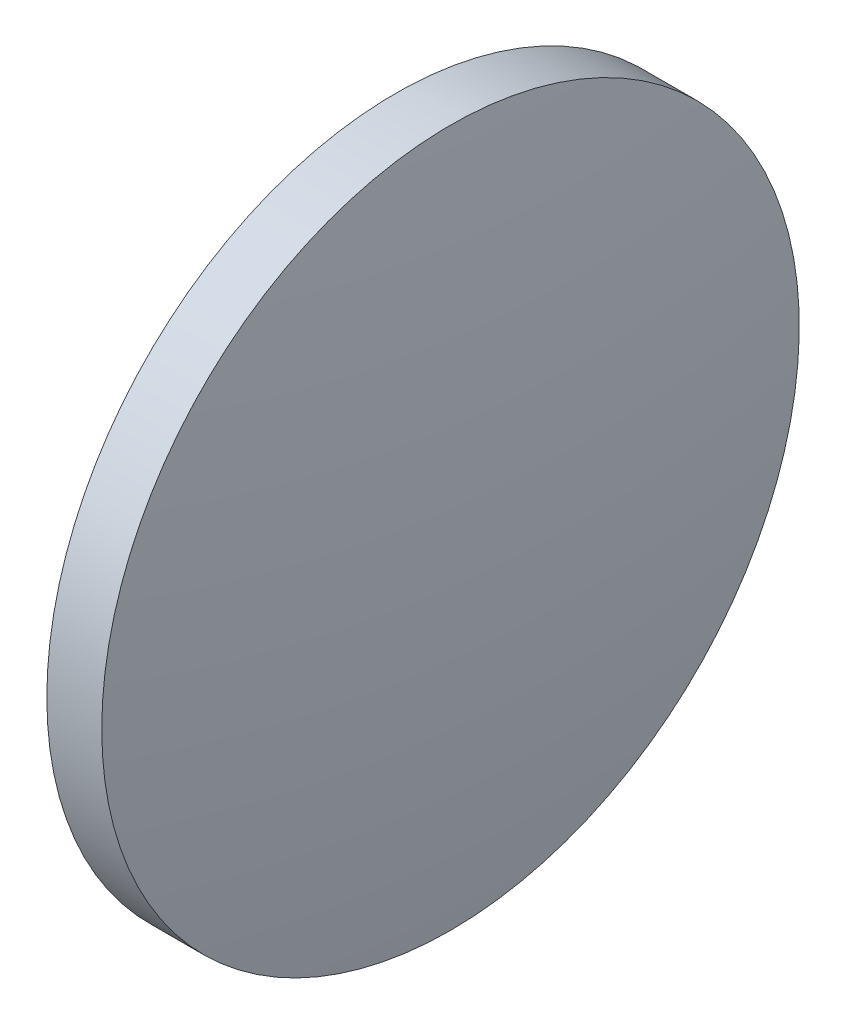
ISO-10303-21;
HEADER;
FILE_DESCRIPTION(('STEP AP214'),'2;1');
FILE_NAME('part.step','',(''),(''),'','','');
FILE_SCHEMA(('AUTOMOTIVE_DESIGN { 1 0 10303 214 1 1 1 1 }'));
ENDSEC;
DATA;
#1=APPLICATION_CONTEXT('core data for automotive mechanical design processes');
#2=APPLICATION_PROTOCOL_DEFINITION('international standard','automotive_design',2000,#1);
#3=PRODUCT_CONTEXT('',#1,'mechanical');
#4=PRODUCT('Part','Part','',(#3));
#5=PRODUCT_RELATED_PRODUCT_CATEGORY('part','',(#4));
#6=PRODUCT_DEFINITION_FORMATION('','',#4);
#7=PRODUCT_DEFINITION_CONTEXT('part definition',#1,'design');
#8=PRODUCT_DEFINITION('design','',#6,#7);
#9=PRODUCT_DEFINITION_SHAPE('','',#8);
#10=(LENGTH_UNIT() NAMED_UNIT(*) SI_UNIT(.MILLI.,.METRE.));
#11=(NAMED_UNIT(*) PLANE_ANGLE_UNIT() SI_UNIT($,.RADIAN.));
#12=(NAMED_UNIT(*) SI_UNIT($,.STERADIAN.) SOLID_ANGLE_UNIT());
#13=UNCERTAINTY_MEASURE_WITH_UNIT(LENGTH_MEASURE(1.E-05),#10,'distance_accuracy_value','');
#14=(GEOMETRIC_REPRESENTATION_CONTEXT(3) GLOBAL_UNCERTAINTY_ASSIGNED_CONTEXT((#13)) GLOBAL_UNIT_ASSIGNED_CONTEXT((#10,
#11,#12)) REPRESENTATION_CONTEXT('',''));
#15=CARTESIAN_POINT('',(0.,0.,0.));
#16=DIRECTION('',(0.,0.,1.));
#17=DIRECTION('',(1.,0.,0.));
#18=AXIS2_PLACEMENT_3D('',#15,#16,#17);
#19=CARTESIAN_POINT('',(347.340178840713,72.7689658525148,0.));
#20=DIRECTION('',(-1.,0.,0.));
#21=DIRECTION('',(0.,-1.,0.));
#22=AXIS2_PLACEMENT_3D('',#19,#20,#21);
#23=SPHERICAL_SURFACE('',#22,91.0539442275721);
#24=CARTESIAN_POINT('',(437.50408935594,72.7689658525148,0.));
#25=DIRECTION('',(-1.,0.,0.));
#26=DIRECTION('',(0.,0.,1.));
#27=AXIS2_PLACEMENT_3D('',#24,#25,#26);
#28=CIRCLE('',#27,12.7);
#29=CARTESIAN_POINT('',(437.50408935594,72.7689658525148,12.7));
#30=VERTEX_POINT('',#29);
#31=EDGE_CURVE('E10',#30,#30,#28,.T.);
#32=ORIENTED_EDGE('',*,*,#31,.F.);
#33=EDGE_LOOP('',(#32));
#34=FACE_BOUND('',#33,.T.);
#35=ADVANCED_FACE('F35',(#34),#23,.T.);
#36=CARTESIAN_POINT('',(429.799415808485,72.7689658525148,0.));
#37=DIRECTION('',(-1.,0.,0.));
#38=DIRECTION('',(0.,0.,1.));
#39=AXIS2_PLACEMENT_3D('',#36,#37,#38);
#40=CYLINDRICAL_SURFACE('',#39,12.7);
#41=CARTESIAN_POINT('',(435.50408935594,72.7689658525148,0.));
#42=DIRECTION('',(-1.,0.,0.));
#43=DIRECTION('',(0.,0.,1.));
#44=AXIS2_PLACEMENT_3D('',#41,#42,#43);
#45=CIRCLE('',#44,12.7);
#46=CARTESIAN_POINT('',(435.50408935594,72.7689658525148,12.7));
#47=VERTEX_POINT('',#46);
#48=EDGE_CURVE('E41',#47,#47,#45,.T.);
#49=ORIENTED_EDGE('',*,*,#48,.F.);
#50=EDGE_LOOP('',(#49));
#51=FACE_BOUND('',#50,.T.);
#52=ORIENTED_EDGE('',*,*,#31,.T.);
#53=EDGE_LOOP('',(#52));
#54=FACE_BOUND('',#53,.T.);
#55=ADVANCED_FACE('F49',(#51,#54),#40,.T.);
#56=CARTESIAN_POINT('',(435.50408935594,72.7689658525148,0.));
#57=DIRECTION('',(1.,0.,0.));
#58=DIRECTION('',(0.,0.,-1.));
#59=AXIS2_PLACEMENT_3D('',#56,#57,#58);
#60=PLANE('',#59);
#61=ORIENTED_EDGE('',*,*,#48,.T.);
#62=EDGE_LOOP('',(#61));
#63=FACE_BOUND('',#62,.T.);
#64=ADVANCED_FACE('F47',(#63),#60,.F.);
#65=CLOSED_SHELL('',(#35,#55,#64));
#66=MANIFOLD_SOLID_BREP('B2',#65);
#67=ADVANCED_BREP_SHAPE_REPRESENTATION('',(#18,#66),#14);
#68=SHAPE_DEFINITION_REPRESENTATION(#9,#67);
ENDSEC;
END-ISO-10303-21;
